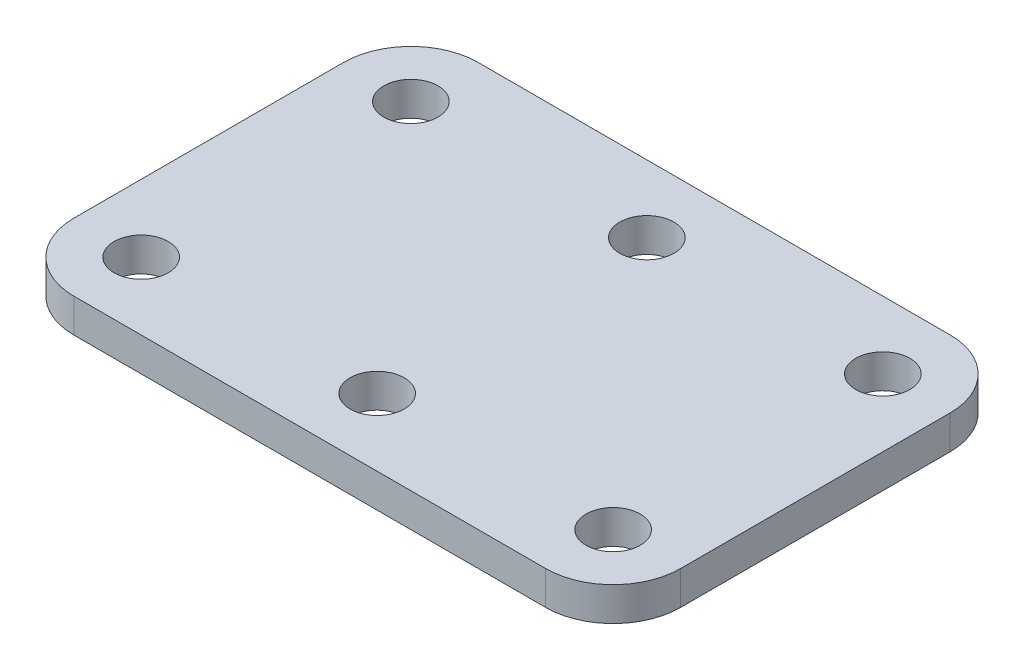
ISO-10303-21;
HEADER;
FILE_DESCRIPTION(('STEP AP214'),'2;1');
FILE_NAME('part.step','',(''),(''),'','','');
FILE_SCHEMA(('AUTOMOTIVE_DESIGN { 1 0 10303 214 1 1 1 1 }'));
ENDSEC;
DATA;
#1=APPLICATION_CONTEXT('core data for automotive mechanical design processes');
#2=APPLICATION_PROTOCOL_DEFINITION('international standard','automotive_design',2000,#1);
#3=PRODUCT_CONTEXT('',#1,'mechanical');
#4=PRODUCT('Part','Part','',(#3));
#5=PRODUCT_RELATED_PRODUCT_CATEGORY('part','',(#4));
#6=PRODUCT_DEFINITION_FORMATION('','',#4);
#7=PRODUCT_DEFINITION_CONTEXT('part definition',#1,'design');
#8=PRODUCT_DEFINITION('design','',#6,#7);
#9=PRODUCT_DEFINITION_SHAPE('','',#8);
#10=(LENGTH_UNIT() NAMED_UNIT(*) SI_UNIT(.MILLI.,.METRE.));
#11=(NAMED_UNIT(*) PLANE_ANGLE_UNIT() SI_UNIT($,.RADIAN.));
#12=(NAMED_UNIT(*) SI_UNIT($,.STERADIAN.) SOLID_ANGLE_UNIT());
#13=UNCERTAINTY_MEASURE_WITH_UNIT(LENGTH_MEASURE(1.E-05),#10,'distance_accuracy_value','');
#14=(GEOMETRIC_REPRESENTATION_CONTEXT(3) GLOBAL_UNCERTAINTY_ASSIGNED_CONTEXT((#13)) GLOBAL_UNIT_ASSIGNED_CONTEXT((#10,
#11,#12)) REPRESENTATION_CONTEXT('',''));
#15=CARTESIAN_POINT('',(0.,0.,0.));
#16=DIRECTION('',(0.,0.,1.));
#17=DIRECTION('',(1.,0.,0.));
#18=AXIS2_PLACEMENT_3D('',#15,#16,#17);
#19=CARTESIAN_POINT('',(22.225,3.175,-12.7));
#20=DIRECTION('',(0.,-1.,0.));
#21=DIRECTION('',(0.,0.,-1.));
#22=AXIS2_PLACEMENT_3D('',#19,#20,#21);
#23=CYLINDRICAL_SURFACE('',#22,6.35);
#24=CARTESIAN_POINT('',(22.225,0.,-12.7));
#25=DIRECTION('',(0.,1.,0.));
#26=DIRECTION('',(0.,0.,1.));
#27=AXIS2_PLACEMENT_3D('',#24,#25,#26);
#28=CIRCLE('',#27,6.35);
#29=CARTESIAN_POINT('',(28.575,0.,-12.7));
#30=VERTEX_POINT('',#29);
#31=CARTESIAN_POINT('',(22.225,0.,-19.05));
#32=VERTEX_POINT('',#31);
#33=EDGE_CURVE('E137',#30,#32,#28,.T.);
#34=ORIENTED_EDGE('',*,*,#33,.T.);
#35=DIRECTION('',(0.,-1.,0.));
#36=VECTOR('',#35,1.);
#37=CARTESIAN_POINT('',(22.225,3.175,-19.05));
#38=LINE('',#37,#36);
#39=CARTESIAN_POINT('',(22.225,3.175,-19.05));
#40=VERTEX_POINT('',#39);
#41=EDGE_CURVE('E11',#40,#32,#38,.T.);
#42=ORIENTED_EDGE('',*,*,#41,.F.);
#43=CARTESIAN_POINT('',(22.225,3.175,-12.7));
#44=DIRECTION('',(0.,1.,0.));
#45=DIRECTION('',(0.,0.,1.));
#46=AXIS2_PLACEMENT_3D('',#43,#44,#45);
#47=CIRCLE('',#46,6.35);
#48=CARTESIAN_POINT('',(28.575,3.175,-12.7));
#49=VERTEX_POINT('',#48);
#50=EDGE_CURVE('E152',#49,#40,#47,.T.);
#51=ORIENTED_EDGE('',*,*,#50,.F.);
#52=DIRECTION('',(0.,-1.,0.));
#53=VECTOR('',#52,1.);
#54=CARTESIAN_POINT('',(28.575,3.175,-12.7));
#55=LINE('',#54,#53);
#56=EDGE_CURVE('E133',#49,#30,#55,.T.);
#57=ORIENTED_EDGE('',*,*,#56,.T.);
#58=EDGE_LOOP('',(#34,#42,#51,#57));
#59=FACE_BOUND('',#58,.T.);
#60=ADVANCED_FACE('F41',(#59),#23,.T.);
#61=CARTESIAN_POINT('',(22.225,3.175,-19.05));
#62=DIRECTION('',(0.,0.,1.));
#63=DIRECTION('',(1.,0.,0.));
#64=AXIS2_PLACEMENT_3D('',#61,#62,#63);
#65=PLANE('',#64);
#66=DIRECTION('',(-1.,0.,0.));
#67=VECTOR('',#66,1.);
#68=CARTESIAN_POINT('',(22.225,0.,-19.05));
#69=LINE('',#68,#67);
#70=CARTESIAN_POINT('',(-22.225,0.,-19.05));
#71=VERTEX_POINT('',#70);
#72=EDGE_CURVE('E140',#32,#71,#69,.T.);
#73=ORIENTED_EDGE('',*,*,#72,.T.);
#74=DIRECTION('',(0.,-1.,0.));
#75=VECTOR('',#74,1.);
#76=CARTESIAN_POINT('',(-22.225,3.175,-19.05));
#77=LINE('',#76,#75);
#78=CARTESIAN_POINT('',(-22.225,3.175,-19.05));
#79=VERTEX_POINT('',#78);
#80=EDGE_CURVE('E49',#79,#71,#77,.T.);
#81=ORIENTED_EDGE('',*,*,#80,.F.);
#82=DIRECTION('',(-1.,0.,0.));
#83=VECTOR('',#82,1.);
#84=CARTESIAN_POINT('',(22.225,3.175,-19.05));
#85=LINE('',#84,#83);
#86=EDGE_CURVE('E100',#40,#79,#85,.T.);
#87=ORIENTED_EDGE('',*,*,#86,.F.);
#88=ORIENTED_EDGE('',*,*,#41,.T.);
#89=EDGE_LOOP('',(#73,#81,#87,#88));
#90=FACE_BOUND('',#89,.T.);
#91=ADVANCED_FACE('F253',(#90),#65,.F.);
#92=CARTESIAN_POINT('',(-22.225,3.175,-12.7));
#93=DIRECTION('',(0.,-1.,0.));
#94=DIRECTION('',(0.,0.,-1.));
#95=AXIS2_PLACEMENT_3D('',#92,#93,#94);
#96=CYLINDRICAL_SURFACE('',#95,6.35);
#97=CARTESIAN_POINT('',(-22.225,0.,-12.7));
#98=DIRECTION('',(0.,1.,0.));
#99=DIRECTION('',(0.,0.,1.));
#100=AXIS2_PLACEMENT_3D('',#97,#98,#99);
#101=CIRCLE('',#100,6.35);
#102=CARTESIAN_POINT('',(-28.575,0.,-12.7));
#103=VERTEX_POINT('',#102);
#104=EDGE_CURVE('E143',#71,#103,#101,.T.);
#105=ORIENTED_EDGE('',*,*,#104,.T.);
#106=DIRECTION('',(0.,-1.,0.));
#107=VECTOR('',#106,1.);
#108=CARTESIAN_POINT('',(-28.575,3.175,-12.7));
#109=LINE('',#108,#107);
#110=CARTESIAN_POINT('',(-28.575,3.175,-12.7));
#111=VERTEX_POINT('',#110);
#112=EDGE_CURVE('E159',#111,#103,#109,.T.);
#113=ORIENTED_EDGE('',*,*,#112,.F.);
#114=CARTESIAN_POINT('',(-22.225,3.175,-12.7));
#115=DIRECTION('',(0.,1.,0.));
#116=DIRECTION('',(0.,0.,1.));
#117=AXIS2_PLACEMENT_3D('',#114,#115,#116);
#118=CIRCLE('',#117,6.35);
#119=EDGE_CURVE('E167',#79,#111,#118,.T.);
#120=ORIENTED_EDGE('',*,*,#119,.F.);
#121=ORIENTED_EDGE('',*,*,#80,.T.);
#122=EDGE_LOOP('',(#105,#113,#120,#121));
#123=FACE_BOUND('',#122,.T.);
#124=ADVANCED_FACE('F165',(#123),#96,.T.);
#125=CARTESIAN_POINT('',(-28.575,3.175,12.7));
#126=DIRECTION('',(1.,0.,0.));
#127=DIRECTION('',(0.,0.,-1.));
#128=AXIS2_PLACEMENT_3D('',#125,#126,#127);
#129=PLANE('',#128);
#130=DIRECTION('',(0.,0.,1.));
#131=VECTOR('',#130,1.);
#132=CARTESIAN_POINT('',(-28.575,0.,12.7));
#133=LINE('',#132,#131);
#134=CARTESIAN_POINT('',(-28.575,0.,12.7));
#135=VERTEX_POINT('',#134);
#136=EDGE_CURVE('E145',#103,#135,#133,.T.);
#137=ORIENTED_EDGE('',*,*,#136,.T.);
#138=DIRECTION('',(0.,-1.,0.));
#139=VECTOR('',#138,1.);
#140=CARTESIAN_POINT('',(-28.575,3.175,12.7));
#141=LINE('',#140,#139);
#142=CARTESIAN_POINT('',(-28.575,3.175,12.7));
#143=VERTEX_POINT('',#142);
#144=EDGE_CURVE('E156',#143,#135,#141,.T.);
#145=ORIENTED_EDGE('',*,*,#144,.F.);
#146=DIRECTION('',(0.,0.,1.));
#147=VECTOR('',#146,1.);
#148=CARTESIAN_POINT('',(-28.575,3.175,12.7));
#149=LINE('',#148,#147);
#150=EDGE_CURVE('E179',#111,#143,#149,.T.);
#151=ORIENTED_EDGE('',*,*,#150,.F.);
#152=ORIENTED_EDGE('',*,*,#112,.T.);
#153=EDGE_LOOP('',(#137,#145,#151,#152));
#154=FACE_BOUND('',#153,.T.);
#155=ADVANCED_FACE('F175',(#154),#129,.F.);
#156=CARTESIAN_POINT('',(-22.225,3.175,12.7));
#157=DIRECTION('',(0.,-1.,0.));
#158=DIRECTION('',(0.,0.,-1.));
#159=AXIS2_PLACEMENT_3D('',#156,#157,#158);
#160=CYLINDRICAL_SURFACE('',#159,6.35);
#161=CARTESIAN_POINT('',(-22.225,0.,12.7));
#162=DIRECTION('',(0.,1.,0.));
#163=DIRECTION('',(0.,0.,-1.));
#164=AXIS2_PLACEMENT_3D('',#161,#162,#163);
#165=CIRCLE('',#164,6.35);
#166=CARTESIAN_POINT('',(-22.225,0.,19.05));
#167=VERTEX_POINT('',#166);
#168=EDGE_CURVE('E147',#135,#167,#165,.T.);
#169=ORIENTED_EDGE('',*,*,#168,.T.);
#170=DIRECTION('',(0.,-1.,0.));
#171=VECTOR('',#170,1.);
#172=CARTESIAN_POINT('',(-22.225,3.175,19.05));
#173=LINE('',#172,#171);
#174=CARTESIAN_POINT('',(-22.225,3.175,19.05));
#175=VERTEX_POINT('',#174);
#176=EDGE_CURVE('E128',#175,#167,#173,.T.);
#177=ORIENTED_EDGE('',*,*,#176,.F.);
#178=CARTESIAN_POINT('',(-22.225,3.175,12.7));
#179=DIRECTION('',(0.,1.,0.));
#180=DIRECTION('',(0.,0.,-1.));
#181=AXIS2_PLACEMENT_3D('',#178,#179,#180);
#182=CIRCLE('',#181,6.35);
#183=EDGE_CURVE('E119',#143,#175,#182,.T.);
#184=ORIENTED_EDGE('',*,*,#183,.F.);
#185=ORIENTED_EDGE('',*,*,#144,.T.);
#186=EDGE_LOOP('',(#169,#177,#184,#185));
#187=FACE_BOUND('',#186,.T.);
#188=ADVANCED_FACE('F178',(#187),#160,.T.);
#189=CARTESIAN_POINT('',(22.225,3.175,19.05));
#190=DIRECTION('',(0.,0.,-1.));
#191=DIRECTION('',(-1.,0.,0.));
#192=AXIS2_PLACEMENT_3D('',#189,#190,#191);
#193=PLANE('',#192);
#194=DIRECTION('',(1.,0.,0.));
#195=VECTOR('',#194,1.);
#196=CARTESIAN_POINT('',(22.225,0.,19.05));
#197=LINE('',#196,#195);
#198=CARTESIAN_POINT('',(22.225,0.,19.05));
#199=VERTEX_POINT('',#198);
#200=EDGE_CURVE('E127',#167,#199,#197,.T.);
#201=ORIENTED_EDGE('',*,*,#200,.T.);
#202=DIRECTION('',(0.,-1.,0.));
#203=VECTOR('',#202,1.);
#204=CARTESIAN_POINT('',(22.225,3.175,19.05));
#205=LINE('',#204,#203);
#206=CARTESIAN_POINT('',(22.225,3.175,19.05));
#207=VERTEX_POINT('',#206);
#208=EDGE_CURVE('E124',#207,#199,#205,.T.);
#209=ORIENTED_EDGE('',*,*,#208,.F.);
#210=DIRECTION('',(1.,0.,0.));
#211=VECTOR('',#210,1.);
#212=CARTESIAN_POINT('',(22.225,3.175,19.05));
#213=LINE('',#212,#211);
#214=EDGE_CURVE('E113',#175,#207,#213,.T.);
#215=ORIENTED_EDGE('',*,*,#214,.F.);
#216=ORIENTED_EDGE('',*,*,#176,.T.);
#217=EDGE_LOOP('',(#201,#209,#215,#216));
#218=FACE_BOUND('',#217,.T.);
#219=ADVANCED_FACE('F125',(#218),#193,.F.);
#220=CARTESIAN_POINT('',(22.225,3.175,12.7));
#221=DIRECTION('',(0.,-1.,0.));
#222=DIRECTION('',(0.,0.,-1.));
#223=AXIS2_PLACEMENT_3D('',#220,#221,#222);
#224=CYLINDRICAL_SURFACE('',#223,6.35);
#225=CARTESIAN_POINT('',(22.225,0.,12.7));
#226=DIRECTION('',(0.,1.,0.));
#227=DIRECTION('',(0.,0.,1.));
#228=AXIS2_PLACEMENT_3D('',#225,#226,#227);
#229=CIRCLE('',#228,6.35);
#230=CARTESIAN_POINT('',(28.575,0.,12.7));
#231=VERTEX_POINT('',#230);
#232=EDGE_CURVE('E86',#199,#231,#229,.T.);
#233=ORIENTED_EDGE('',*,*,#232,.T.);
#234=DIRECTION('',(0.,-1.,0.));
#235=VECTOR('',#234,1.);
#236=CARTESIAN_POINT('',(28.575,3.175,12.7));
#237=LINE('',#236,#235);
#238=CARTESIAN_POINT('',(28.575,3.175,12.7));
#239=VERTEX_POINT('',#238);
#240=EDGE_CURVE('E129',#239,#231,#237,.T.);
#241=ORIENTED_EDGE('',*,*,#240,.F.);
#242=CARTESIAN_POINT('',(22.225,3.175,12.7));
#243=DIRECTION('',(0.,1.,0.));
#244=DIRECTION('',(0.,0.,1.));
#245=AXIS2_PLACEMENT_3D('',#242,#243,#244);
#246=CIRCLE('',#245,6.35);
#247=EDGE_CURVE('E117',#207,#239,#246,.T.);
#248=ORIENTED_EDGE('',*,*,#247,.F.);
#249=ORIENTED_EDGE('',*,*,#208,.T.);
#250=EDGE_LOOP('',(#233,#241,#248,#249));
#251=FACE_BOUND('',#250,.T.);
#252=ADVANCED_FACE('F131',(#251),#224,.T.);
#253=CARTESIAN_POINT('',(28.575,3.175,12.7));
#254=DIRECTION('',(-1.,0.,0.));
#255=DIRECTION('',(0.,0.,1.));
#256=AXIS2_PLACEMENT_3D('',#253,#254,#255);
#257=PLANE('',#256);
#258=DIRECTION('',(0.,0.,-1.));
#259=VECTOR('',#258,1.);
#260=CARTESIAN_POINT('',(28.575,0.,12.7));
#261=LINE('',#260,#259);
#262=EDGE_CURVE('E92',#231,#30,#261,.T.);
#263=ORIENTED_EDGE('',*,*,#262,.T.);
#264=ORIENTED_EDGE('',*,*,#56,.F.);
#265=DIRECTION('',(0.,0.,-1.));
#266=VECTOR('',#265,1.);
#267=CARTESIAN_POINT('',(28.575,3.175,12.7));
#268=LINE('',#267,#266);
#269=EDGE_CURVE('E57',#239,#49,#268,.T.);
#270=ORIENTED_EDGE('',*,*,#269,.F.);
#271=ORIENTED_EDGE('',*,*,#240,.T.);
#272=EDGE_LOOP('',(#263,#264,#270,#271));
#273=FACE_BOUND('',#272,.T.);
#274=ADVANCED_FACE('F225',(#273),#257,.F.);
#275=CARTESIAN_POINT('',(22.225,3.175,-12.7));
#276=DIRECTION('',(0.,1.,0.));
#277=DIRECTION('',(0.,0.,1.));
#278=AXIS2_PLACEMENT_3D('',#275,#276,#277);
#279=PLANE('',#278);
#280=CARTESIAN_POINT('',(-22.225,3.175,-12.7));
#281=DIRECTION('',(0.,1.,0.));
#282=DIRECTION('',(0.,0.,1.));
#283=AXIS2_PLACEMENT_3D('',#280,#281,#282);
#284=CIRCLE('',#283,2.5527);
#285=CARTESIAN_POINT('',(-22.225,3.175,-10.1473));
#286=VERTEX_POINT('',#285);
#287=EDGE_CURVE('E217',#286,#286,#284,.T.);
#288=ORIENTED_EDGE('',*,*,#287,.F.);
#289=EDGE_LOOP('',(#288));
#290=FACE_BOUND('',#289,.T.);
#291=CARTESIAN_POINT('',(0.,3.175,-12.7));
#292=DIRECTION('',(0.,1.,0.));
#293=DIRECTION('',(0.,0.,1.));
#294=AXIS2_PLACEMENT_3D('',#291,#292,#293);
#295=CIRCLE('',#294,2.5527);
#296=CARTESIAN_POINT('',(0.,3.175,-10.1473));
#297=VERTEX_POINT('',#296);
#298=EDGE_CURVE('E211',#297,#297,#295,.T.);
#299=ORIENTED_EDGE('',*,*,#298,.F.);
#300=EDGE_LOOP('',(#299));
#301=FACE_BOUND('',#300,.T.);
#302=CARTESIAN_POINT('',(22.225,3.175,-12.7));
#303=DIRECTION('',(0.,1.,0.));
#304=DIRECTION('',(0.,0.,1.));
#305=AXIS2_PLACEMENT_3D('',#302,#303,#304);
#306=CIRCLE('',#305,2.5527);
#307=CARTESIAN_POINT('',(22.225,3.175,-10.1473));
#308=VERTEX_POINT('',#307);
#309=EDGE_CURVE('E205',#308,#308,#306,.T.);
#310=ORIENTED_EDGE('',*,*,#309,.F.);
#311=EDGE_LOOP('',(#310));
#312=FACE_BOUND('',#311,.T.);
#313=CARTESIAN_POINT('',(0.,3.175,12.7));
#314=DIRECTION('',(0.,1.,0.));
#315=DIRECTION('',(0.,0.,1.));
#316=AXIS2_PLACEMENT_3D('',#313,#314,#315);
#317=CIRCLE('',#316,2.5527);
#318=CARTESIAN_POINT('',(0.,3.175,15.2527));
#319=VERTEX_POINT('',#318);
#320=EDGE_CURVE('E199',#319,#319,#317,.T.);
#321=ORIENTED_EDGE('',*,*,#320,.F.);
#322=EDGE_LOOP('',(#321));
#323=FACE_BOUND('',#322,.T.);
#324=CARTESIAN_POINT('',(22.2250000000003,3.175,12.7));
#325=DIRECTION('',(0.,1.,0.));
#326=DIRECTION('',(0.,0.,1.));
#327=AXIS2_PLACEMENT_3D('',#324,#325,#326);
#328=CIRCLE('',#327,2.5527);
#329=CARTESIAN_POINT('',(22.2250000000003,3.175,15.2527));
#330=VERTEX_POINT('',#329);
#331=EDGE_CURVE('E193',#330,#330,#328,.T.);
#332=ORIENTED_EDGE('',*,*,#331,.F.);
#333=EDGE_LOOP('',(#332));
#334=FACE_BOUND('',#333,.T.);
#335=CARTESIAN_POINT('',(-22.225,3.175,12.7));
#336=DIRECTION('',(0.,1.,0.));
#337=DIRECTION('',(0.,0.,1.));
#338=AXIS2_PLACEMENT_3D('',#335,#336,#337);
#339=CIRCLE('',#338,2.5527);
#340=CARTESIAN_POINT('',(-22.225,3.175,15.2527));
#341=VERTEX_POINT('',#340);
#342=EDGE_CURVE('E187',#341,#341,#339,.T.);
#343=ORIENTED_EDGE('',*,*,#342,.F.);
#344=EDGE_LOOP('',(#343));
#345=FACE_BOUND('',#344,.T.);
#346=ORIENTED_EDGE('',*,*,#50,.T.);
#347=ORIENTED_EDGE('',*,*,#86,.T.);
#348=ORIENTED_EDGE('',*,*,#119,.T.);
#349=ORIENTED_EDGE('',*,*,#150,.T.);
#350=ORIENTED_EDGE('',*,*,#183,.T.);
#351=ORIENTED_EDGE('',*,*,#214,.T.);
#352=ORIENTED_EDGE('',*,*,#247,.T.);
#353=ORIENTED_EDGE('',*,*,#269,.T.);
#354=EDGE_LOOP('',(#346,#347,#348,#349,#350,#351,#352,#353));
#355=FACE_BOUND('',#354,.T.);
#356=ADVANCED_FACE('F115',(#290,#301,#312,#323,#334,#345,#355),#279,.T.);
#357=CARTESIAN_POINT('',(22.225,0.,-12.7));
#358=DIRECTION('',(0.,1.,0.));
#359=DIRECTION('',(0.,0.,1.));
#360=AXIS2_PLACEMENT_3D('',#357,#358,#359);
#361=PLANE('',#360);
#362=CARTESIAN_POINT('',(-22.225,0.,-12.7));
#363=DIRECTION('',(0.,1.,0.));
#364=DIRECTION('',(0.,0.,1.));
#365=AXIS2_PLACEMENT_3D('',#362,#363,#364);
#366=CIRCLE('',#365,2.5527);
#367=CARTESIAN_POINT('',(-22.225,0.,-10.1473));
#368=VERTEX_POINT('',#367);
#369=EDGE_CURVE('E214',#368,#368,#366,.T.);
#370=ORIENTED_EDGE('',*,*,#369,.T.);
#371=EDGE_LOOP('',(#370));
#372=FACE_BOUND('',#371,.T.);
#373=CARTESIAN_POINT('',(0.,0.,-12.7));
#374=DIRECTION('',(0.,1.,0.));
#375=DIRECTION('',(0.,0.,1.));
#376=AXIS2_PLACEMENT_3D('',#373,#374,#375);
#377=CIRCLE('',#376,2.5527);
#378=CARTESIAN_POINT('',(0.,0.,-10.1473));
#379=VERTEX_POINT('',#378);
#380=EDGE_CURVE('E208',#379,#379,#377,.T.);
#381=ORIENTED_EDGE('',*,*,#380,.T.);
#382=EDGE_LOOP('',(#381));
#383=FACE_BOUND('',#382,.T.);
#384=CARTESIAN_POINT('',(22.225,0.,-12.7));
#385=DIRECTION('',(0.,1.,0.));
#386=DIRECTION('',(0.,0.,1.));
#387=AXIS2_PLACEMENT_3D('',#384,#385,#386);
#388=CIRCLE('',#387,2.5527);
#389=CARTESIAN_POINT('',(22.225,0.,-10.1473));
#390=VERTEX_POINT('',#389);
#391=EDGE_CURVE('E202',#390,#390,#388,.T.);
#392=ORIENTED_EDGE('',*,*,#391,.T.);
#393=EDGE_LOOP('',(#392));
#394=FACE_BOUND('',#393,.T.);
#395=CARTESIAN_POINT('',(0.,0.,12.7));
#396=DIRECTION('',(0.,1.,0.));
#397=DIRECTION('',(0.,0.,1.));
#398=AXIS2_PLACEMENT_3D('',#395,#396,#397);
#399=CIRCLE('',#398,2.5527);
#400=CARTESIAN_POINT('',(0.,0.,15.2527));
#401=VERTEX_POINT('',#400);
#402=EDGE_CURVE('E196',#401,#401,#399,.T.);
#403=ORIENTED_EDGE('',*,*,#402,.T.);
#404=EDGE_LOOP('',(#403));
#405=FACE_BOUND('',#404,.T.);
#406=CARTESIAN_POINT('',(22.2250000000003,0.,12.7));
#407=DIRECTION('',(0.,1.,0.));
#408=DIRECTION('',(0.,0.,1.));
#409=AXIS2_PLACEMENT_3D('',#406,#407,#408);
#410=CIRCLE('',#409,2.5527);
#411=CARTESIAN_POINT('',(22.2250000000003,0.,15.2527));
#412=VERTEX_POINT('',#411);
#413=EDGE_CURVE('E190',#412,#412,#410,.T.);
#414=ORIENTED_EDGE('',*,*,#413,.T.);
#415=EDGE_LOOP('',(#414));
#416=FACE_BOUND('',#415,.T.);
#417=CARTESIAN_POINT('',(-22.225,0.,12.7));
#418=DIRECTION('',(0.,1.,0.));
#419=DIRECTION('',(0.,0.,1.));
#420=AXIS2_PLACEMENT_3D('',#417,#418,#419);
#421=CIRCLE('',#420,2.5527);
#422=CARTESIAN_POINT('',(-22.225,0.,15.2527));
#423=VERTEX_POINT('',#422);
#424=EDGE_CURVE('E141',#423,#423,#421,.T.);
#425=ORIENTED_EDGE('',*,*,#424,.T.);
#426=EDGE_LOOP('',(#425));
#427=FACE_BOUND('',#426,.T.);
#428=ORIENTED_EDGE('',*,*,#33,.F.);
#429=ORIENTED_EDGE('',*,*,#262,.F.);
#430=ORIENTED_EDGE('',*,*,#232,.F.);
#431=ORIENTED_EDGE('',*,*,#200,.F.);
#432=ORIENTED_EDGE('',*,*,#168,.F.);
#433=ORIENTED_EDGE('',*,*,#136,.F.);
#434=ORIENTED_EDGE('',*,*,#104,.F.);
#435=ORIENTED_EDGE('',*,*,#72,.F.);
#436=EDGE_LOOP('',(#428,#429,#430,#431,#432,#433,#434,#435));
#437=FACE_BOUND('',#436,.T.);
#438=ADVANCED_FACE('F171',(#372,#383,#394,#405,#416,#427,#437),#361,.F.);
#439=CARTESIAN_POINT('',(-22.225,3.175,12.7));
#440=DIRECTION('',(0.,1.,0.));
#441=DIRECTION('',(0.,0.,1.));
#442=AXIS2_PLACEMENT_3D('',#439,#440,#441);
#443=CYLINDRICAL_SURFACE('',#442,2.5527);
#444=ORIENTED_EDGE('',*,*,#424,.F.);
#445=EDGE_LOOP('',(#444));
#446=FACE_BOUND('',#445,.T.);
#447=ORIENTED_EDGE('',*,*,#342,.T.);
#448=EDGE_LOOP('',(#447));
#449=FACE_BOUND('',#448,.T.);
#450=ADVANCED_FACE('F237',(#446,#449),#443,.F.);
#451=CARTESIAN_POINT('',(22.2250000000003,3.175,12.7));
#452=DIRECTION('',(0.,1.,0.));
#453=DIRECTION('',(0.,0.,1.));
#454=AXIS2_PLACEMENT_3D('',#451,#452,#453);
#455=CYLINDRICAL_SURFACE('',#454,2.5527);
#456=ORIENTED_EDGE('',*,*,#413,.F.);
#457=EDGE_LOOP('',(#456));
#458=FACE_BOUND('',#457,.T.);
#459=ORIENTED_EDGE('',*,*,#331,.T.);
#460=EDGE_LOOP('',(#459));
#461=FACE_BOUND('',#460,.T.);
#462=ADVANCED_FACE('F239',(#458,#461),#455,.F.);
#463=CARTESIAN_POINT('',(0.,3.175,12.7));
#464=DIRECTION('',(0.,1.,0.));
#465=DIRECTION('',(0.,0.,1.));
#466=AXIS2_PLACEMENT_3D('',#463,#464,#465);
#467=CYLINDRICAL_SURFACE('',#466,2.5527);
#468=ORIENTED_EDGE('',*,*,#402,.F.);
#469=EDGE_LOOP('',(#468));
#470=FACE_BOUND('',#469,.T.);
#471=ORIENTED_EDGE('',*,*,#320,.T.);
#472=EDGE_LOOP('',(#471));
#473=FACE_BOUND('',#472,.T.);
#474=ADVANCED_FACE('F246',(#470,#473),#467,.F.);
#475=CARTESIAN_POINT('',(22.225,3.175,-12.7));
#476=DIRECTION('',(0.,1.,0.));
#477=DIRECTION('',(0.,0.,1.));
#478=AXIS2_PLACEMENT_3D('',#475,#476,#477);
#479=CYLINDRICAL_SURFACE('',#478,2.5527);
#480=ORIENTED_EDGE('',*,*,#391,.F.);
#481=EDGE_LOOP('',(#480));
#482=FACE_BOUND('',#481,.T.);
#483=ORIENTED_EDGE('',*,*,#309,.T.);
#484=EDGE_LOOP('',(#483));
#485=FACE_BOUND('',#484,.T.);
#486=ADVANCED_FACE('F334',(#482,#485),#479,.F.);
#487=CARTESIAN_POINT('',(0.,3.175,-12.7));
#488=DIRECTION('',(0.,1.,0.));
#489=DIRECTION('',(0.,0.,1.));
#490=AXIS2_PLACEMENT_3D('',#487,#488,#489);
#491=CYLINDRICAL_SURFACE('',#490,2.5527);
#492=ORIENTED_EDGE('',*,*,#380,.F.);
#493=EDGE_LOOP('',(#492));
#494=FACE_BOUND('',#493,.T.);
#495=ORIENTED_EDGE('',*,*,#298,.T.);
#496=EDGE_LOOP('',(#495));
#497=FACE_BOUND('',#496,.T.);
#498=ADVANCED_FACE('F344',(#494,#497),#491,.F.);
#499=CARTESIAN_POINT('',(-22.225,3.175,-12.7));
#500=DIRECTION('',(0.,1.,0.));
#501=DIRECTION('',(0.,0.,1.));
#502=AXIS2_PLACEMENT_3D('',#499,#500,#501);
#503=CYLINDRICAL_SURFACE('',#502,2.5527);
#504=ORIENTED_EDGE('',*,*,#369,.F.);
#505=EDGE_LOOP('',(#504));
#506=FACE_BOUND('',#505,.T.);
#507=ORIENTED_EDGE('',*,*,#287,.T.);
#508=EDGE_LOOP('',(#507));
#509=FACE_BOUND('',#508,.T.);
#510=ADVANCED_FACE('F221',(#506,#509),#503,.F.);
#511=CLOSED_SHELL('',(#60,#91,#124,#155,#188,#219,#252,#274,#356,#438,#450,#462,#474,#486,#498,#510));
#512=MANIFOLD_SOLID_BREP('B2',#511);
#513=ADVANCED_BREP_SHAPE_REPRESENTATION('',(#18,#512),#14);
#514=SHAPE_DEFINITION_REPRESENTATION(#9,#513);
ENDSEC;
END-ISO-10303-21;
